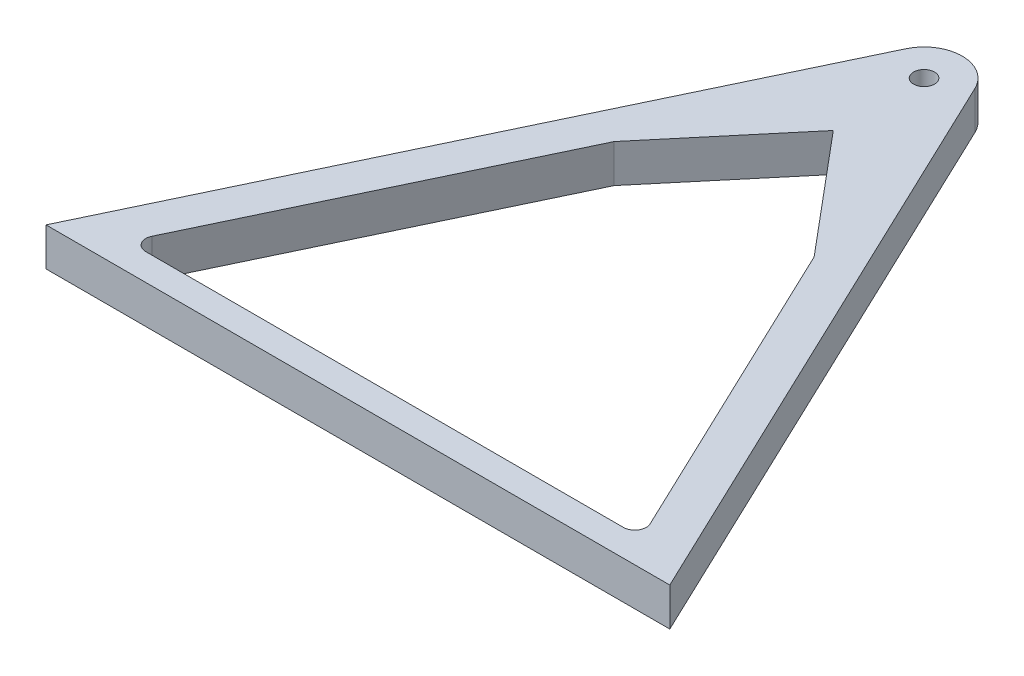
ISO-10303-21;
HEADER;
FILE_DESCRIPTION(('STEP AP214'),'2;1');
FILE_NAME('part.step','',(''),(''),'','','');
FILE_SCHEMA(('AUTOMOTIVE_DESIGN { 1 0 10303 214 1 1 1 1 }'));
ENDSEC;
DATA;
#1=APPLICATION_CONTEXT('core data for automotive mechanical design processes');
#2=APPLICATION_PROTOCOL_DEFINITION('international standard','automotive_design',2000,#1);
#3=PRODUCT_CONTEXT('',#1,'mechanical');
#4=PRODUCT('Part','Part','',(#3));
#5=PRODUCT_RELATED_PRODUCT_CATEGORY('part','',(#4));
#6=PRODUCT_DEFINITION_FORMATION('','',#4);
#7=PRODUCT_DEFINITION_CONTEXT('part definition',#1,'design');
#8=PRODUCT_DEFINITION('design','',#6,#7);
#9=PRODUCT_DEFINITION_SHAPE('','',#8);
#10=(LENGTH_UNIT() NAMED_UNIT(*) SI_UNIT(.MILLI.,.METRE.));
#11=(NAMED_UNIT(*) PLANE_ANGLE_UNIT() SI_UNIT($,.RADIAN.));
#12=(NAMED_UNIT(*) SI_UNIT($,.STERADIAN.) SOLID_ANGLE_UNIT());
#13=UNCERTAINTY_MEASURE_WITH_UNIT(LENGTH_MEASURE(1.E-05),#10,'distance_accuracy_value','');
#14=(GEOMETRIC_REPRESENTATION_CONTEXT(3) GLOBAL_UNCERTAINTY_ASSIGNED_CONTEXT((#13)) GLOBAL_UNIT_ASSIGNED_CONTEXT((#10,
#11,#12)) REPRESENTATION_CONTEXT('',''));
#15=CARTESIAN_POINT('',(0.,0.,0.));
#16=DIRECTION('',(0.,0.,1.));
#17=DIRECTION('',(1.,0.,0.));
#18=AXIS2_PLACEMENT_3D('',#15,#16,#17);
#19=CARTESIAN_POINT('',(57.5979035625476,10.,-27.4310015716633));
#20=DIRECTION('',(-0.902839657325466,0.,0.429977386801254));
#21=DIRECTION('',(0.429977386801254,0.,0.902839657325466));
#22=AXIS2_PLACEMENT_3D('',#19,#20,#21);
#23=PLANE('',#22);
#24=DIRECTION('',(0.,1.,0.));
#25=VECTOR('',#24,1.);
#26=CARTESIAN_POINT('',(26.19375,0.,-93.3714814930229));
#27=LINE('',#26,#25);
#28=CARTESIAN_POINT('',(26.19375,0.,-93.3714814930229));
#29=VERTEX_POINT('',#28);
#30=CARTESIAN_POINT('',(26.19375,10.,-93.3714814930229));
#31=VERTEX_POINT('',#30);
#32=EDGE_CURVE('E207',#29,#31,#27,.T.);
#33=ORIENTED_EDGE('',*,*,#32,.F.);
#34=DIRECTION('',(-0.429977386801254,0.,-0.902839657325466));
#35=VECTOR('',#34,1.);
#36=CARTESIAN_POINT('',(57.5979035625476,0.,-27.4310015716633));
#37=LINE('',#36,#35);
#38=CARTESIAN_POINT('',(65.2850878696599,0.,-11.2899321604038));
#39=VERTEX_POINT('',#38);
#40=EDGE_CURVE('E152',#39,#29,#37,.T.);
#41=ORIENTED_EDGE('',*,*,#40,.F.);
#42=DIRECTION('',(0.,-1.,0.));
#43=VECTOR('',#42,1.);
#44=CARTESIAN_POINT('',(65.2850878696599,10.,-11.2899321604038));
#45=LINE('',#44,#43);
#46=CARTESIAN_POINT('',(65.2850878696599,10.,-11.2899321604038));
#47=VERTEX_POINT('',#46);
#48=EDGE_CURVE('E171',#39,#47,#45,.F.);
#49=ORIENTED_EDGE('',*,*,#48,.T.);
#50=DIRECTION('',(-0.429977386801254,0.,-0.902839657325466));
#51=VECTOR('',#50,1.);
#52=CARTESIAN_POINT('',(57.5979035625476,10.,-27.4310015716633));
#53=LINE('',#52,#51);
#54=EDGE_CURVE('E187',#47,#31,#53,.T.);
#55=ORIENTED_EDGE('',*,*,#54,.T.);
#56=EDGE_LOOP('',(#33,#41,#49,#55));
#57=FACE_BOUND('',#56,.T.);
#58=ADVANCED_FACE('F35',(#57),#23,.T.);
#59=CARTESIAN_POINT('',(0.,10.,-7.));
#60=DIRECTION('',(0.,0.,-1.));
#61=DIRECTION('',(-1.,0.,0.));
#62=AXIS2_PLACEMENT_3D('',#59,#60,#61);
#63=PLANE('',#62);
#64=DIRECTION('',(1.,0.,0.));
#65=VECTOR('',#64,1.);
#66=CARTESIAN_POINT('',(0.,10.,-7.));
#67=LINE('',#66,#65);
#68=CARTESIAN_POINT('',(-62.5765688976835,10.,-6.99999999999999));
#69=VERTEX_POINT('',#68);
#70=CARTESIAN_POINT('',(62.5765688976835,10.,-7.00000000000002));
#71=VERTEX_POINT('',#70);
#72=EDGE_CURVE('E186',#69,#71,#67,.T.);
#73=ORIENTED_EDGE('',*,*,#72,.T.);
#74=DIRECTION('',(0.,-1.,0.));
#75=VECTOR('',#74,1.);
#76=CARTESIAN_POINT('',(62.5765688976835,0.,-7.00000000000002));
#77=LINE('',#76,#75);
#78=CARTESIAN_POINT('',(62.5765688976835,0.,-7.00000000000002));
#79=VERTEX_POINT('',#78);
#80=EDGE_CURVE('E175',#71,#79,#77,.T.);
#81=ORIENTED_EDGE('',*,*,#80,.T.);
#82=DIRECTION('',(1.,0.,0.));
#83=VECTOR('',#82,1.);
#84=CARTESIAN_POINT('',(0.,0.,-7.));
#85=LINE('',#84,#83);
#86=CARTESIAN_POINT('',(-62.5765688976835,0.,-6.99999999999999));
#87=VERTEX_POINT('',#86);
#88=EDGE_CURVE('E146',#87,#79,#85,.T.);
#89=ORIENTED_EDGE('',*,*,#88,.F.);
#90=DIRECTION('',(0.,-1.,0.));
#91=VECTOR('',#90,1.);
#92=CARTESIAN_POINT('',(-62.5765688976835,10.,-6.99999999999999));
#93=LINE('',#92,#91);
#94=EDGE_CURVE('E57',#87,#69,#93,.F.);
#95=ORIENTED_EDGE('',*,*,#94,.T.);
#96=EDGE_LOOP('',(#73,#81,#89,#95));
#97=FACE_BOUND('',#96,.T.);
#98=ADVANCED_FACE('F181',(#97),#63,.T.);
#99=CARTESIAN_POINT('',(0.,10.,0.));
#100=DIRECTION('',(0.,0.,1.));
#101=DIRECTION('',(1.,0.,0.));
#102=AXIS2_PLACEMENT_3D('',#99,#100,#101);
#103=PLANE('',#102);
#104=DIRECTION('',(-1.,0.,0.));
#105=VECTOR('',#104,1.);
#106=CARTESIAN_POINT('',(0.,0.,0.));
#107=LINE('',#106,#105);
#108=CARTESIAN_POINT('',(81.7380819389478,0.,0.));
#109=VERTEX_POINT('',#108);
#110=CARTESIAN_POINT('',(-81.7380819389478,0.,0.));
#111=VERTEX_POINT('',#110);
#112=EDGE_CURVE('E195',#109,#111,#107,.T.);
#113=ORIENTED_EDGE('',*,*,#112,.F.);
#114=DIRECTION('',(0.,-1.,0.));
#115=VECTOR('',#114,1.);
#116=CARTESIAN_POINT('',(81.7380819389478,10.,0.));
#117=LINE('',#116,#115);
#118=CARTESIAN_POINT('',(81.7380819389478,10.,0.));
#119=VERTEX_POINT('',#118);
#120=EDGE_CURVE('E158',#119,#109,#117,.T.);
#121=ORIENTED_EDGE('',*,*,#120,.F.);
#122=DIRECTION('',(-1.,0.,0.));
#123=VECTOR('',#122,1.);
#124=CARTESIAN_POINT('',(0.,10.,0.));
#125=LINE('',#124,#123);
#126=CARTESIAN_POINT('',(-81.7380819389478,10.,0.));
#127=VERTEX_POINT('',#126);
#128=EDGE_CURVE('E145',#119,#127,#125,.T.);
#129=ORIENTED_EDGE('',*,*,#128,.T.);
#130=DIRECTION('',(0.,-1.,0.));
#131=VECTOR('',#130,1.);
#132=CARTESIAN_POINT('',(-81.7380819389478,10.,0.));
#133=LINE('',#132,#131);
#134=EDGE_CURVE('E156',#127,#111,#133,.T.);
#135=ORIENTED_EDGE('',*,*,#134,.T.);
#136=EDGE_LOOP('',(#113,#121,#129,#135));
#137=FACE_BOUND('',#136,.T.);
#138=ADVANCED_FACE('F224',(#137),#103,.T.);
#139=CARTESIAN_POINT('',(66.6263001358022,10.,-31.7307754396758));
#140=DIRECTION('',(0.902839657325466,0.,-0.429977386801253));
#141=DIRECTION('',(-0.429977386801253,0.,-0.902839657325466));
#142=AXIS2_PLACEMENT_3D('',#139,#140,#141);
#143=PLANE('',#142);
#144=DIRECTION('',(0.429977386801253,0.,0.902839657325466));
#145=VECTOR('',#144,1.);
#146=CARTESIAN_POINT('',(66.6263001358022,0.,-31.7307754396758));
#147=LINE('',#146,#145);
#148=CARTESIAN_POINT('',(9.02839657325467,0.,-152.671255361035));
#149=VERTEX_POINT('',#148);
#150=EDGE_CURVE('E198',#149,#109,#147,.T.);
#151=ORIENTED_EDGE('',*,*,#150,.F.);
#152=DIRECTION('',(0.,-1.,0.));
#153=VECTOR('',#152,1.);
#154=CARTESIAN_POINT('',(9.02839657325467,10.,-152.671255361035));
#155=LINE('',#154,#153);
#156=CARTESIAN_POINT('',(9.02839657325467,10.,-152.671255361035));
#157=VERTEX_POINT('',#156);
#158=EDGE_CURVE('E167',#149,#157,#155,.F.);
#159=ORIENTED_EDGE('',*,*,#158,.T.);
#160=DIRECTION('',(0.429977386801253,0.,0.902839657325466));
#161=VECTOR('',#160,1.);
#162=CARTESIAN_POINT('',(66.6263001358022,10.,-31.7307754396758));
#163=LINE('',#162,#161);
#164=EDGE_CURVE('E149',#157,#119,#163,.T.);
#165=ORIENTED_EDGE('',*,*,#164,.T.);
#166=ORIENTED_EDGE('',*,*,#120,.T.);
#167=EDGE_LOOP('',(#151,#159,#165,#166));
#168=FACE_BOUND('',#167,.T.);
#169=ADVANCED_FACE('F231',(#168),#143,.T.);
#170=CARTESIAN_POINT('',(-66.6263001358022,10.,-31.7307754396758));
#171=DIRECTION('',(-0.902839657325466,0.,-0.429977386801253));
#172=DIRECTION('',(-0.429977386801253,0.,0.902839657325466));
#173=AXIS2_PLACEMENT_3D('',#170,#171,#172);
#174=PLANE('',#173);
#175=DIRECTION('',(0.429977386801253,0.,-0.902839657325467));
#176=VECTOR('',#175,1.);
#177=CARTESIAN_POINT('',(-66.6263001358022,10.,-31.7307754396758));
#178=LINE('',#177,#176);
#179=CARTESIAN_POINT('',(-9.02839657325463,10.,-152.671255361035));
#180=VERTEX_POINT('',#179);
#181=EDGE_CURVE('E191',#127,#180,#178,.T.);
#182=ORIENTED_EDGE('',*,*,#181,.T.);
#183=DIRECTION('',(0.,-1.,0.));
#184=VECTOR('',#183,1.);
#185=CARTESIAN_POINT('',(-9.02839657325466,10.,-152.671255361035));
#186=LINE('',#185,#184);
#187=CARTESIAN_POINT('',(-9.02839657325463,0.,-152.671255361035));
#188=VERTEX_POINT('',#187);
#189=EDGE_CURVE('E162',#180,#188,#186,.T.);
#190=ORIENTED_EDGE('',*,*,#189,.T.);
#191=DIRECTION('',(0.429977386801253,0.,-0.902839657325467));
#192=VECTOR('',#191,1.);
#193=CARTESIAN_POINT('',(-66.6263001358022,0.,-31.7307754396758));
#194=LINE('',#193,#192);
#195=EDGE_CURVE('E201',#111,#188,#194,.T.);
#196=ORIENTED_EDGE('',*,*,#195,.F.);
#197=ORIENTED_EDGE('',*,*,#134,.F.);
#198=EDGE_LOOP('',(#182,#190,#196,#197));
#199=FACE_BOUND('',#198,.T.);
#200=ADVANCED_FACE('F228',(#199),#174,.T.);
#201=CARTESIAN_POINT('',(-57.5979035625475,10.,-27.4310015716633));
#202=DIRECTION('',(0.902839657325466,0.,0.429977386801253));
#203=DIRECTION('',(0.429977386801253,0.,-0.902839657325466));
#204=AXIS2_PLACEMENT_3D('',#201,#202,#203);
#205=PLANE('',#204);
#206=DIRECTION('',(0.,1.,0.));
#207=VECTOR('',#206,1.);
#208=CARTESIAN_POINT('',(-26.19375,0.,-93.371481493023));
#209=LINE('',#208,#207);
#210=CARTESIAN_POINT('',(-26.19375,0.,-93.371481493023));
#211=VERTEX_POINT('',#210);
#212=CARTESIAN_POINT('',(-26.19375,10.,-93.371481493023));
#213=VERTEX_POINT('',#212);
#214=EDGE_CURVE('E120',#211,#213,#209,.T.);
#215=ORIENTED_EDGE('',*,*,#214,.T.);
#216=DIRECTION('',(-0.429977386801253,0.,0.902839657325466));
#217=VECTOR('',#216,1.);
#218=CARTESIAN_POINT('',(-57.5979035625475,10.,-27.4310015716633));
#219=LINE('',#218,#217);
#220=CARTESIAN_POINT('',(-65.2850878696599,10.,-11.2899321604038));
#221=VERTEX_POINT('',#220);
#222=EDGE_CURVE('E159',#213,#221,#219,.T.);
#223=ORIENTED_EDGE('',*,*,#222,.T.);
#224=DIRECTION('',(0.,-1.,0.));
#225=VECTOR('',#224,1.);
#226=CARTESIAN_POINT('',(-65.2850878696599,0.,-11.2899321604038));
#227=LINE('',#226,#225);
#228=CARTESIAN_POINT('',(-65.2850878696599,0.,-11.2899321604038));
#229=VERTEX_POINT('',#228);
#230=EDGE_CURVE('E144',#221,#229,#227,.T.);
#231=ORIENTED_EDGE('',*,*,#230,.T.);
#232=DIRECTION('',(-0.429977386801253,0.,0.902839657325466));
#233=VECTOR('',#232,1.);
#234=CARTESIAN_POINT('',(-57.5979035625475,0.,-27.4310015716633));
#235=LINE('',#234,#233);
#236=EDGE_CURVE('E136',#211,#229,#235,.T.);
#237=ORIENTED_EDGE('',*,*,#236,.F.);
#238=EDGE_LOOP('',(#215,#223,#231,#237));
#239=FACE_BOUND('',#238,.T.);
#240=ADVANCED_FACE('F142',(#239),#205,.T.);
#241=CARTESIAN_POINT('',(0.,10.,0.));
#242=DIRECTION('',(0.,1.,0.));
#243=DIRECTION('',(0.,0.,1.));
#244=AXIS2_PLACEMENT_3D('',#241,#242,#243);
#245=PLANE('',#244);
#246=ORIENTED_EDGE('',*,*,#222,.F.);
#247=DIRECTION('',(0.642787609686538,0.,-0.766044443118979));
#248=VECTOR('',#247,1.);
#249=CARTESIAN_POINT('',(-26.19375,10.,-93.371481493023));
#250=LINE('',#249,#248);
#251=CARTESIAN_POINT('',(0.,10.,-124.587977159038));
#252=VERTEX_POINT('',#251);
#253=EDGE_CURVE('E125',#213,#252,#250,.T.);
#254=ORIENTED_EDGE('',*,*,#253,.T.);
#255=DIRECTION('',(0.642787609686538,0.,0.766044443118979));
#256=VECTOR('',#255,1.);
#257=CARTESIAN_POINT('',(0.,10.,-124.587977159038));
#258=LINE('',#257,#256);
#259=EDGE_CURVE('E139',#252,#31,#258,.T.);
#260=ORIENTED_EDGE('',*,*,#259,.T.);
#261=ORIENTED_EDGE('',*,*,#54,.F.);
#262=CARTESIAN_POINT('',(62.5765688976835,10.,-10.));
#263=DIRECTION('',(0.,1.,0.));
#264=DIRECTION('',(0.,0.,1.));
#265=AXIS2_PLACEMENT_3D('',#262,#263,#264);
#266=CIRCLE('',#265,3.);
#267=EDGE_CURVE('E50',#47,#71,#266,.F.);
#268=ORIENTED_EDGE('',*,*,#267,.T.);
#269=ORIENTED_EDGE('',*,*,#72,.F.);
#270=CARTESIAN_POINT('',(-62.5765688976835,10.,-9.99999999999999));
#271=DIRECTION('',(0.,1.,0.));
#272=DIRECTION('',(0.,0.,1.));
#273=AXIS2_PLACEMENT_3D('',#270,#271,#272);
#274=CIRCLE('',#273,3.);
#275=EDGE_CURVE('E11',#69,#221,#274,.F.);
#276=ORIENTED_EDGE('',*,*,#275,.T.);
#277=EDGE_LOOP('',(#246,#254,#260,#261,#268,#269,#276));
#278=FACE_BOUND('',#277,.T.);
#279=CARTESIAN_POINT('',(0.,10.,-148.371481493023));
#280=DIRECTION('',(0.,1.,0.));
#281=DIRECTION('',(0.,0.,1.));
#282=AXIS2_PLACEMENT_3D('',#279,#280,#281);
#283=CIRCLE('',#282,2.75);
#284=CARTESIAN_POINT('',(0.,10.,-145.621481493023));
#285=VERTEX_POINT('',#284);
#286=EDGE_CURVE('E255',#285,#285,#283,.T.);
#287=ORIENTED_EDGE('',*,*,#286,.F.);
#288=EDGE_LOOP('',(#287));
#289=FACE_BOUND('',#288,.T.);
#290=ORIENTED_EDGE('',*,*,#164,.F.);
#291=CARTESIAN_POINT('',(0.,10.,-148.371481493023));
#292=DIRECTION('',(0.,1.,0.));
#293=DIRECTION('',(0.,0.,1.));
#294=AXIS2_PLACEMENT_3D('',#291,#292,#293);
#295=CIRCLE('',#294,10.);
#296=EDGE_CURVE('E169',#157,#180,#295,.T.);
#297=ORIENTED_EDGE('',*,*,#296,.T.);
#298=ORIENTED_EDGE('',*,*,#181,.F.);
#299=ORIENTED_EDGE('',*,*,#128,.F.);
#300=EDGE_LOOP('',(#290,#297,#298,#299));
#301=FACE_BOUND('',#300,.T.);
#302=ADVANCED_FACE('F184',(#278,#289,#301),#245,.T.);
#303=CARTESIAN_POINT('',(0.,0.,0.));
#304=DIRECTION('',(0.,1.,0.));
#305=DIRECTION('',(0.,0.,1.));
#306=AXIS2_PLACEMENT_3D('',#303,#304,#305);
#307=PLANE('',#306);
#308=DIRECTION('',(0.642787609686538,0.,-0.766044443118979));
#309=VECTOR('',#308,1.);
#310=CARTESIAN_POINT('',(-26.19375,0.,-93.371481493023));
#311=LINE('',#310,#309);
#312=CARTESIAN_POINT('',(0.,0.,-124.587977159038));
#313=VERTEX_POINT('',#312);
#314=EDGE_CURVE('E123',#211,#313,#311,.T.);
#315=ORIENTED_EDGE('',*,*,#314,.F.);
#316=ORIENTED_EDGE('',*,*,#236,.T.);
#317=CARTESIAN_POINT('',(-62.5765688976835,0.,-9.99999999999999));
#318=DIRECTION('',(0.,1.,0.));
#319=DIRECTION('',(0.,0.,1.));
#320=AXIS2_PLACEMENT_3D('',#317,#318,#319);
#321=CIRCLE('',#320,3.);
#322=EDGE_CURVE('E43',#229,#87,#321,.T.);
#323=ORIENTED_EDGE('',*,*,#322,.T.);
#324=ORIENTED_EDGE('',*,*,#88,.T.);
#325=CARTESIAN_POINT('',(62.5765688976835,0.,-10.));
#326=DIRECTION('',(0.,1.,0.));
#327=DIRECTION('',(0.,0.,1.));
#328=AXIS2_PLACEMENT_3D('',#325,#326,#327);
#329=CIRCLE('',#328,3.);
#330=EDGE_CURVE('E178',#79,#39,#329,.T.);
#331=ORIENTED_EDGE('',*,*,#330,.T.);
#332=ORIENTED_EDGE('',*,*,#40,.T.);
#333=DIRECTION('',(0.642787609686538,0.,0.766044443118979));
#334=VECTOR('',#333,1.);
#335=CARTESIAN_POINT('',(0.,0.,-124.587977159038));
#336=LINE('',#335,#334);
#337=EDGE_CURVE('E130',#313,#29,#336,.T.);
#338=ORIENTED_EDGE('',*,*,#337,.F.);
#339=EDGE_LOOP('',(#315,#316,#323,#324,#331,#332,#338));
#340=FACE_BOUND('',#339,.T.);
#341=CARTESIAN_POINT('',(0.,0.,-148.371481493023));
#342=DIRECTION('',(0.,1.,0.));
#343=DIRECTION('',(0.,0.,1.));
#344=AXIS2_PLACEMENT_3D('',#341,#342,#343);
#345=CIRCLE('',#344,2.75);
#346=CARTESIAN_POINT('',(0.,0.,-145.621481493023));
#347=VERTEX_POINT('',#346);
#348=EDGE_CURVE('E199',#347,#347,#345,.T.);
#349=ORIENTED_EDGE('',*,*,#348,.T.);
#350=EDGE_LOOP('',(#349));
#351=FACE_BOUND('',#350,.T.);
#352=CARTESIAN_POINT('',(0.,0.,-148.371481493023));
#353=DIRECTION('',(0.,1.,0.));
#354=DIRECTION('',(0.,0.,1.));
#355=AXIS2_PLACEMENT_3D('',#352,#353,#354);
#356=CIRCLE('',#355,10.);
#357=EDGE_CURVE('E165',#188,#149,#356,.F.);
#358=ORIENTED_EDGE('',*,*,#357,.T.);
#359=ORIENTED_EDGE('',*,*,#150,.T.);
#360=ORIENTED_EDGE('',*,*,#112,.T.);
#361=ORIENTED_EDGE('',*,*,#195,.T.);
#362=EDGE_LOOP('',(#358,#359,#360,#361));
#363=FACE_BOUND('',#362,.T.);
#364=ADVANCED_FACE('F134',(#340,#351,#363),#307,.F.);
#365=CARTESIAN_POINT('',(0.,10.,-148.371481493023));
#366=DIRECTION('',(0.,-1.,0.));
#367=DIRECTION('',(0.,0.,-1.));
#368=AXIS2_PLACEMENT_3D('',#365,#366,#367);
#369=CYLINDRICAL_SURFACE('',#368,10.);
#370=ORIENTED_EDGE('',*,*,#296,.F.);
#371=ORIENTED_EDGE('',*,*,#158,.F.);
#372=ORIENTED_EDGE('',*,*,#357,.F.);
#373=ORIENTED_EDGE('',*,*,#189,.F.);
#374=EDGE_LOOP('',(#370,#371,#372,#373));
#375=FACE_BOUND('',#374,.T.);
#376=ADVANCED_FACE('F211',(#375),#369,.T.);
#377=CARTESIAN_POINT('',(62.5765688976835,10.,-10.));
#378=DIRECTION('',(0.,1.,0.));
#379=DIRECTION('',(0.,0.,1.));
#380=AXIS2_PLACEMENT_3D('',#377,#378,#379);
#381=CYLINDRICAL_SURFACE('',#380,3.);
#382=ORIENTED_EDGE('',*,*,#267,.F.);
#383=ORIENTED_EDGE('',*,*,#48,.F.);
#384=ORIENTED_EDGE('',*,*,#330,.F.);
#385=ORIENTED_EDGE('',*,*,#80,.F.);
#386=EDGE_LOOP('',(#382,#383,#384,#385));
#387=FACE_BOUND('',#386,.T.);
#388=ADVANCED_FACE('F209',(#387),#381,.F.);
#389=CARTESIAN_POINT('',(-62.5765688976835,10.,-9.99999999999999));
#390=DIRECTION('',(0.,1.,0.));
#391=DIRECTION('',(0.,0.,1.));
#392=AXIS2_PLACEMENT_3D('',#389,#390,#391);
#393=CYLINDRICAL_SURFACE('',#392,3.);
#394=ORIENTED_EDGE('',*,*,#275,.F.);
#395=ORIENTED_EDGE('',*,*,#94,.F.);
#396=ORIENTED_EDGE('',*,*,#322,.F.);
#397=ORIENTED_EDGE('',*,*,#230,.F.);
#398=EDGE_LOOP('',(#394,#395,#396,#397));
#399=FACE_BOUND('',#398,.T.);
#400=ADVANCED_FACE('F37',(#399),#393,.F.);
#401=CARTESIAN_POINT('',(0.,0.,-148.371481493023));
#402=DIRECTION('',(0.,1.,0.));
#403=DIRECTION('',(0.,0.,1.));
#404=AXIS2_PLACEMENT_3D('',#401,#402,#403);
#405=CYLINDRICAL_SURFACE('',#404,2.75);
#406=ORIENTED_EDGE('',*,*,#348,.F.);
#407=EDGE_LOOP('',(#406));
#408=FACE_BOUND('',#407,.T.);
#409=ORIENTED_EDGE('',*,*,#286,.T.);
#410=EDGE_LOOP('',(#409));
#411=FACE_BOUND('',#410,.T.);
#412=ADVANCED_FACE('F216',(#408,#411),#405,.F.);
#413=CARTESIAN_POINT('',(0.,0.,-124.587977159038));
#414=DIRECTION('',(-0.766044443118979,0.,0.642787609686538));
#415=DIRECTION('',(0.642787609686538,0.,0.766044443118979));
#416=AXIS2_PLACEMENT_3D('',#413,#414,#415);
#417=PLANE('',#416);
#418=ORIENTED_EDGE('',*,*,#259,.F.);
#419=DIRECTION('',(0.,1.,0.));
#420=VECTOR('',#419,1.);
#421=CARTESIAN_POINT('',(0.,0.,-124.587977159038));
#422=LINE('',#421,#420);
#423=EDGE_CURVE('E129',#313,#252,#422,.T.);
#424=ORIENTED_EDGE('',*,*,#423,.F.);
#425=ORIENTED_EDGE('',*,*,#337,.T.);
#426=ORIENTED_EDGE('',*,*,#32,.T.);
#427=EDGE_LOOP('',(#418,#424,#425,#426));
#428=FACE_BOUND('',#427,.T.);
#429=ADVANCED_FACE('F267',(#428),#417,.T.);
#430=CARTESIAN_POINT('',(-26.19375,0.,-93.371481493023));
#431=DIRECTION('',(0.766044443118979,0.,0.642787609686538));
#432=DIRECTION('',(0.642787609686538,0.,-0.766044443118979));
#433=AXIS2_PLACEMENT_3D('',#430,#431,#432);
#434=PLANE('',#433);
#435=ORIENTED_EDGE('',*,*,#253,.F.);
#436=ORIENTED_EDGE('',*,*,#214,.F.);
#437=ORIENTED_EDGE('',*,*,#314,.T.);
#438=ORIENTED_EDGE('',*,*,#423,.T.);
#439=EDGE_LOOP('',(#435,#436,#437,#438));
#440=FACE_BOUND('',#439,.T.);
#441=ADVANCED_FACE('F122',(#440),#434,.T.);
#442=CLOSED_SHELL('',(#58,#98,#138,#169,#200,#240,#302,#364,#376,#388,#400,#412,#429,#441));
#443=MANIFOLD_SOLID_BREP('B2',#442);
#444=ADVANCED_BREP_SHAPE_REPRESENTATION('',(#18,#443),#14);
#445=SHAPE_DEFINITION_REPRESENTATION(#9,#444);
ENDSEC;
END-ISO-10303-21;
